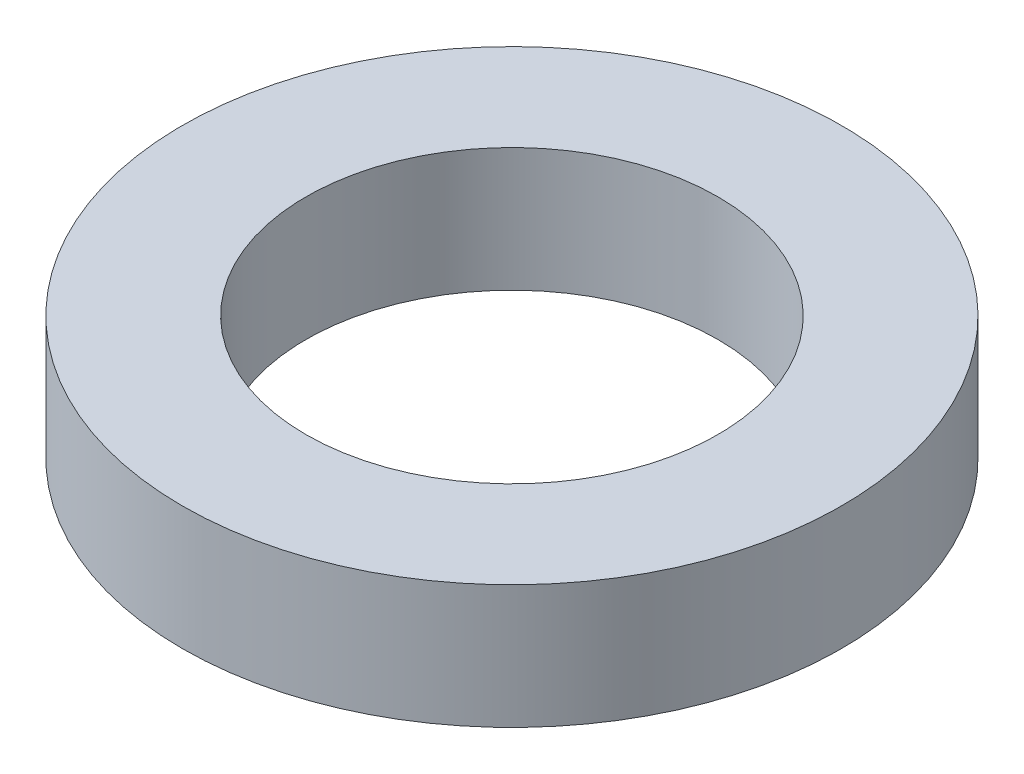
ISO-10303-21;
HEADER;
FILE_DESCRIPTION(('STEP AP214'),'2;1');
FILE_NAME('part.step','',(''),(''),'','','');
FILE_SCHEMA(('AUTOMOTIVE_DESIGN { 1 0 10303 214 1 1 1 1 }'));
ENDSEC;
DATA;
#1=APPLICATION_CONTEXT('core data for automotive mechanical design processes');
#2=APPLICATION_PROTOCOL_DEFINITION('international standard','automotive_design',2000,#1);
#3=PRODUCT_CONTEXT('',#1,'mechanical');
#4=PRODUCT('Part','Part','',(#3));
#5=PRODUCT_RELATED_PRODUCT_CATEGORY('part','',(#4));
#6=PRODUCT_DEFINITION_FORMATION('','',#4);
#7=PRODUCT_DEFINITION_CONTEXT('part definition',#1,'design');
#8=PRODUCT_DEFINITION('design','',#6,#7);
#9=PRODUCT_DEFINITION_SHAPE('','',#8);
#10=(LENGTH_UNIT() NAMED_UNIT(*) SI_UNIT(.MILLI.,.METRE.));
#11=(NAMED_UNIT(*) PLANE_ANGLE_UNIT() SI_UNIT($,.RADIAN.));
#12=(NAMED_UNIT(*) SI_UNIT($,.STERADIAN.) SOLID_ANGLE_UNIT());
#13=UNCERTAINTY_MEASURE_WITH_UNIT(LENGTH_MEASURE(1.E-05),#10,'distance_accuracy_value','');
#14=(GEOMETRIC_REPRESENTATION_CONTEXT(3) GLOBAL_UNCERTAINTY_ASSIGNED_CONTEXT((#13)) GLOBAL_UNIT_ASSIGNED_CONTEXT((#10,
#11,#12)) REPRESENTATION_CONTEXT('',''));
#15=CARTESIAN_POINT('',(0.,0.,0.));
#16=DIRECTION('',(0.,0.,1.));
#17=DIRECTION('',(1.,0.,0.));
#18=AXIS2_PLACEMENT_3D('',#15,#16,#17);
#19=CARTESIAN_POINT('',(0.,30.,0.));
#20=DIRECTION('',(0.,-1.,0.));
#21=DIRECTION('',(0.,0.,-1.));
#22=AXIS2_PLACEMENT_3D('',#19,#20,#21);
#23=CYLINDRICAL_SURFACE('',#22,80.);
#24=CARTESIAN_POINT('',(0.,30.,0.));
#25=DIRECTION('',(0.,1.,0.));
#26=DIRECTION('',(0.,0.,1.));
#27=AXIS2_PLACEMENT_3D('',#24,#25,#26);
#28=CIRCLE('',#27,80.);
#29=CARTESIAN_POINT('',(0.,30.,80.));
#30=VERTEX_POINT('',#29);
#31=EDGE_CURVE('E10',#30,#30,#28,.T.);
#32=ORIENTED_EDGE('',*,*,#31,.F.);
#33=EDGE_LOOP('',(#32));
#34=FACE_BOUND('',#33,.T.);
#35=CARTESIAN_POINT('',(0.,0.,0.));
#36=DIRECTION('',(0.,1.,0.));
#37=DIRECTION('',(0.,0.,1.));
#38=AXIS2_PLACEMENT_3D('',#35,#36,#37);
#39=CIRCLE('',#38,80.);
#40=CARTESIAN_POINT('',(0.,0.,80.));
#41=VERTEX_POINT('',#40);
#42=EDGE_CURVE('E37',#41,#41,#39,.T.);
#43=ORIENTED_EDGE('',*,*,#42,.T.);
#44=EDGE_LOOP('',(#43));
#45=FACE_BOUND('',#44,.T.);
#46=ADVANCED_FACE('F40',(#34,#45),#23,.T.);
#47=CARTESIAN_POINT('',(0.,30.,0.));
#48=DIRECTION('',(0.,1.,0.));
#49=DIRECTION('',(0.,0.,1.));
#50=AXIS2_PLACEMENT_3D('',#47,#48,#49);
#51=PLANE('',#50);
#52=CARTESIAN_POINT('',(0.,30.,0.));
#53=DIRECTION('',(0.,1.,0.));
#54=DIRECTION('',(0.,0.,1.));
#55=AXIS2_PLACEMENT_3D('',#52,#53,#54);
#56=CIRCLE('',#55,50.);
#57=CARTESIAN_POINT('',(0.,30.,50.));
#58=VERTEX_POINT('',#57);
#59=EDGE_CURVE('E50',#58,#58,#56,.T.);
#60=ORIENTED_EDGE('',*,*,#59,.F.);
#61=EDGE_LOOP('',(#60));
#62=FACE_BOUND('',#61,.T.);
#63=ORIENTED_EDGE('',*,*,#31,.T.);
#64=EDGE_LOOP('',(#63));
#65=FACE_BOUND('',#64,.T.);
#66=ADVANCED_FACE('F59',(#62,#65),#51,.T.);
#67=CARTESIAN_POINT('',(0.,0.,0.));
#68=DIRECTION('',(0.,1.,0.));
#69=DIRECTION('',(0.,0.,1.));
#70=AXIS2_PLACEMENT_3D('',#67,#68,#69);
#71=PLANE('',#70);
#72=CARTESIAN_POINT('',(0.,0.,0.));
#73=DIRECTION('',(0.,1.,0.));
#74=DIRECTION('',(0.,0.,1.));
#75=AXIS2_PLACEMENT_3D('',#72,#73,#74);
#76=CIRCLE('',#75,50.);
#77=CARTESIAN_POINT('',(0.,0.,50.));
#78=VERTEX_POINT('',#77);
#79=EDGE_CURVE('E47',#78,#78,#76,.T.);
#80=ORIENTED_EDGE('',*,*,#79,.T.);
#81=EDGE_LOOP('',(#80));
#82=FACE_BOUND('',#81,.T.);
#83=ORIENTED_EDGE('',*,*,#42,.F.);
#84=EDGE_LOOP('',(#83));
#85=FACE_BOUND('',#84,.T.);
#86=ADVANCED_FACE('F58',(#82,#85),#71,.F.);
#87=CARTESIAN_POINT('',(0.,30.,0.));
#88=DIRECTION('',(0.,-1.,0.));
#89=DIRECTION('',(0.,0.,-1.));
#90=AXIS2_PLACEMENT_3D('',#87,#88,#89);
#91=CYLINDRICAL_SURFACE('',#90,50.);
#92=ORIENTED_EDGE('',*,*,#59,.T.);
#93=EDGE_LOOP('',(#92));
#94=FACE_BOUND('',#93,.T.);
#95=ORIENTED_EDGE('',*,*,#79,.F.);
#96=EDGE_LOOP('',(#95));
#97=FACE_BOUND('',#96,.T.);
#98=ADVANCED_FACE('F54',(#94,#97),#91,.F.);
#99=CLOSED_SHELL('',(#46,#66,#86,#98));
#100=MANIFOLD_SOLID_BREP('B2',#99);
#101=ADVANCED_BREP_SHAPE_REPRESENTATION('',(#18,#100),#14);
#102=SHAPE_DEFINITION_REPRESENTATION(#9,#101);
ENDSEC;
END-ISO-10303-21;
